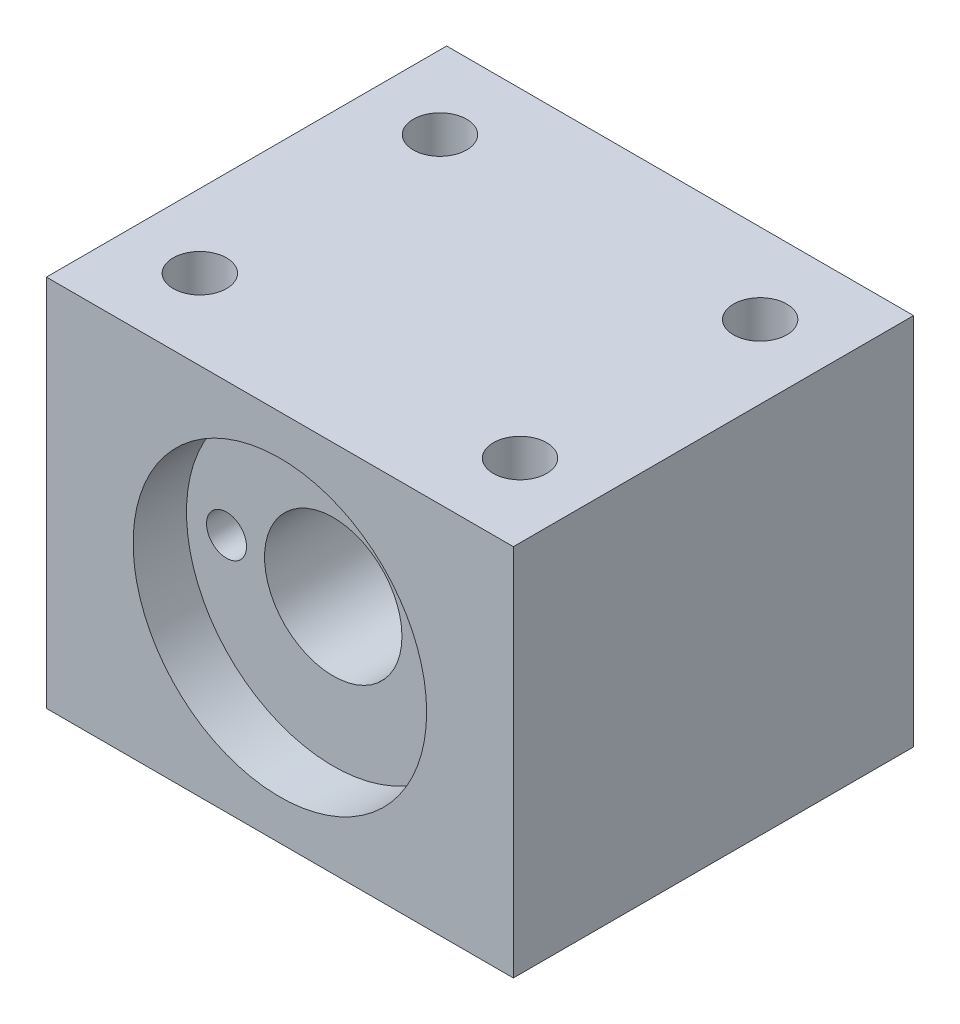
ISO-10303-21;
HEADER;
FILE_DESCRIPTION(('STEP AP214'),'2;1');
FILE_NAME('part.step','',(''),(''),'','','');
FILE_SCHEMA(('AUTOMOTIVE_DESIGN { 1 0 10303 214 1 1 1 1 }'));
ENDSEC;
DATA;
#1=APPLICATION_CONTEXT('core data for automotive mechanical design processes');
#2=APPLICATION_PROTOCOL_DEFINITION('international standard','automotive_design',2000,#1);
#3=PRODUCT_CONTEXT('',#1,'mechanical');
#4=PRODUCT('Part','Part','',(#3));
#5=PRODUCT_RELATED_PRODUCT_CATEGORY('part','',(#4));
#6=PRODUCT_DEFINITION_FORMATION('','',#4);
#7=PRODUCT_DEFINITION_CONTEXT('part definition',#1,'design');
#8=PRODUCT_DEFINITION('design','',#6,#7);
#9=PRODUCT_DEFINITION_SHAPE('','',#8);
#10=(LENGTH_UNIT() NAMED_UNIT(*) SI_UNIT(.MILLI.,.METRE.));
#11=(NAMED_UNIT(*) PLANE_ANGLE_UNIT() SI_UNIT($,.RADIAN.));
#12=(NAMED_UNIT(*) SI_UNIT($,.STERADIAN.) SOLID_ANGLE_UNIT());
#13=UNCERTAINTY_MEASURE_WITH_UNIT(LENGTH_MEASURE(1.E-05),#10,'distance_accuracy_value','');
#14=(GEOMETRIC_REPRESENTATION_CONTEXT(3) GLOBAL_UNCERTAINTY_ASSIGNED_CONTEXT((#13)) GLOBAL_UNIT_ASSIGNED_CONTEXT((#10,
#11,#12)) REPRESENTATION_CONTEXT('',''));
#15=CARTESIAN_POINT('',(0.,0.,0.));
#16=DIRECTION('',(0.,0.,1.));
#17=DIRECTION('',(1.,0.,0.));
#18=AXIS2_PLACEMENT_3D('',#15,#16,#17);
#19=CARTESIAN_POINT('',(0.,0.,0.));
#20=DIRECTION('',(0.,0.,1.));
#21=DIRECTION('',(1.,0.,0.));
#22=AXIS2_PLACEMENT_3D('',#19,#20,#21);
#23=CYLINDRICAL_SURFACE('',#22,5.15);
#24=CARTESIAN_POINT('',(0.,0.,0.));
#25=DIRECTION('',(0.,0.,1.));
#26=DIRECTION('',(1.,0.,0.));
#27=AXIS2_PLACEMENT_3D('',#24,#25,#26);
#28=CIRCLE('',#27,5.15);
#29=CARTESIAN_POINT('',(5.15,0.,0.));
#30=VERTEX_POINT('',#29);
#31=EDGE_CURVE('E102',#30,#30,#28,.T.);
#32=ORIENTED_EDGE('',*,*,#31,.F.);
#33=EDGE_LOOP('',(#32));
#34=FACE_BOUND('',#33,.T.);
#35=CARTESIAN_POINT('',(0.,0.,26.));
#36=DIRECTION('',(0.,0.,1.));
#37=DIRECTION('',(1.,0.,0.));
#38=AXIS2_PLACEMENT_3D('',#35,#36,#37);
#39=CIRCLE('',#38,5.15);
#40=CARTESIAN_POINT('',(5.15,0.,26.));
#41=VERTEX_POINT('',#40);
#42=EDGE_CURVE('E37',#41,#41,#39,.F.);
#43=ORIENTED_EDGE('',*,*,#42,.F.);
#44=EDGE_LOOP('',(#43));
#45=FACE_BOUND('',#44,.T.);
#46=ADVANCED_FACE('F33',(#34,#45),#23,.F.);
#47=CARTESIAN_POINT('',(-17.5,-14.,30.));
#48=DIRECTION('',(1.,0.,0.));
#49=DIRECTION('',(0.,0.,-1.));
#50=AXIS2_PLACEMENT_3D('',#47,#48,#49);
#51=PLANE('',#50);
#52=DIRECTION('',(0.,-1.,0.));
#53=VECTOR('',#52,1.);
#54=CARTESIAN_POINT('',(-17.5,-14.,0.));
#55=LINE('',#54,#53);
#56=CARTESIAN_POINT('',(-17.5,14.,0.));
#57=VERTEX_POINT('',#56);
#58=CARTESIAN_POINT('',(-17.5,-14.,0.));
#59=VERTEX_POINT('',#58);
#60=EDGE_CURVE('E99',#57,#59,#55,.T.);
#61=ORIENTED_EDGE('',*,*,#60,.T.);
#62=DIRECTION('',(0.,0.,-1.));
#63=VECTOR('',#62,1.);
#64=CARTESIAN_POINT('',(-17.5,-14.,30.));
#65=LINE('',#64,#63);
#66=CARTESIAN_POINT('',(-17.5,-14.,30.));
#67=VERTEX_POINT('',#66);
#68=EDGE_CURVE('E11',#67,#59,#65,.T.);
#69=ORIENTED_EDGE('',*,*,#68,.F.);
#70=DIRECTION('',(0.,-1.,0.));
#71=VECTOR('',#70,1.);
#72=CARTESIAN_POINT('',(-17.5,-14.,30.));
#73=LINE('',#72,#71);
#74=CARTESIAN_POINT('',(-17.5,14.,30.));
#75=VERTEX_POINT('',#74);
#76=EDGE_CURVE('E86',#75,#67,#73,.T.);
#77=ORIENTED_EDGE('',*,*,#76,.F.);
#78=DIRECTION('',(0.,0.,-1.));
#79=VECTOR('',#78,1.);
#80=CARTESIAN_POINT('',(-17.5,14.,30.));
#81=LINE('',#80,#79);
#82=EDGE_CURVE('E95',#75,#57,#81,.T.);
#83=ORIENTED_EDGE('',*,*,#82,.T.);
#84=EDGE_LOOP('',(#61,#69,#77,#83));
#85=FACE_BOUND('',#84,.T.);
#86=ADVANCED_FACE('F35',(#85),#51,.F.);
#87=CARTESIAN_POINT('',(17.5,-14.,30.));
#88=DIRECTION('',(0.,1.,0.));
#89=DIRECTION('',(-1.,0.,0.));
#90=AXIS2_PLACEMENT_3D('',#87,#88,#89);
#91=PLANE('',#90);
#92=DIRECTION('',(1.,0.,0.));
#93=VECTOR('',#92,1.);
#94=CARTESIAN_POINT('',(17.5,-14.,0.));
#95=LINE('',#94,#93);
#96=CARTESIAN_POINT('',(17.5,-14.,0.));
#97=VERTEX_POINT('',#96);
#98=EDGE_CURVE('E90',#59,#97,#95,.T.);
#99=ORIENTED_EDGE('',*,*,#98,.T.);
#100=DIRECTION('',(0.,0.,-1.));
#101=VECTOR('',#100,1.);
#102=CARTESIAN_POINT('',(17.5,-14.,30.));
#103=LINE('',#102,#101);
#104=CARTESIAN_POINT('',(17.5,-14.,30.));
#105=VERTEX_POINT('',#104);
#106=EDGE_CURVE('E43',#105,#97,#103,.T.);
#107=ORIENTED_EDGE('',*,*,#106,.F.);
#108=DIRECTION('',(1.,0.,0.));
#109=VECTOR('',#108,1.);
#110=CARTESIAN_POINT('',(17.5,-14.,30.));
#111=LINE('',#110,#109);
#112=EDGE_CURVE('E81',#67,#105,#111,.T.);
#113=ORIENTED_EDGE('',*,*,#112,.F.);
#114=ORIENTED_EDGE('',*,*,#68,.T.);
#115=EDGE_LOOP('',(#99,#107,#113,#114));
#116=FACE_BOUND('',#115,.T.);
#117=ADVANCED_FACE('F89',(#116),#91,.F.);
#118=CARTESIAN_POINT('',(17.5,-14.,30.));
#119=DIRECTION('',(-1.,0.,0.));
#120=DIRECTION('',(0.,0.,1.));
#121=AXIS2_PLACEMENT_3D('',#118,#119,#120);
#122=PLANE('',#121);
#123=DIRECTION('',(0.,1.,0.));
#124=VECTOR('',#123,1.);
#125=CARTESIAN_POINT('',(17.5,-14.,0.));
#126=LINE('',#125,#124);
#127=CARTESIAN_POINT('',(17.5,14.,0.));
#128=VERTEX_POINT('',#127);
#129=EDGE_CURVE('E68',#97,#128,#126,.T.);
#130=ORIENTED_EDGE('',*,*,#129,.T.);
#131=DIRECTION('',(0.,0.,-1.));
#132=VECTOR('',#131,1.);
#133=CARTESIAN_POINT('',(17.5,14.,30.));
#134=LINE('',#133,#132);
#135=CARTESIAN_POINT('',(17.5,14.,30.));
#136=VERTEX_POINT('',#135);
#137=EDGE_CURVE('E91',#136,#128,#134,.T.);
#138=ORIENTED_EDGE('',*,*,#137,.F.);
#139=DIRECTION('',(0.,1.,0.));
#140=VECTOR('',#139,1.);
#141=CARTESIAN_POINT('',(17.5,-14.,30.));
#142=LINE('',#141,#140);
#143=EDGE_CURVE('E84',#105,#136,#142,.T.);
#144=ORIENTED_EDGE('',*,*,#143,.F.);
#145=ORIENTED_EDGE('',*,*,#106,.T.);
#146=EDGE_LOOP('',(#130,#138,#144,#145));
#147=FACE_BOUND('',#146,.T.);
#148=ADVANCED_FACE('F93',(#147),#122,.F.);
#149=CARTESIAN_POINT('',(17.5,14.,30.));
#150=DIRECTION('',(0.,-1.,0.));
#151=DIRECTION('',(1.,0.,0.));
#152=AXIS2_PLACEMENT_3D('',#149,#150,#151);
#153=PLANE('',#152);
#154=CARTESIAN_POINT('',(-12.,14.,6.));
#155=DIRECTION('',(0.,1.,0.));
#156=DIRECTION('',(1.,0.,0.));
#157=AXIS2_PLACEMENT_3D('',#154,#155,#156);
#158=CIRCLE('',#157,2.);
#159=CARTESIAN_POINT('',(-10.,14.,6.));
#160=VERTEX_POINT('',#159);
#161=EDGE_CURVE('E140',#160,#160,#158,.T.);
#162=ORIENTED_EDGE('',*,*,#161,.F.);
#163=EDGE_LOOP('',(#162));
#164=FACE_BOUND('',#163,.T.);
#165=CARTESIAN_POINT('',(12.,14.,5.99999999999999));
#166=DIRECTION('',(0.,1.,0.));
#167=DIRECTION('',(-1.,0.,0.));
#168=AXIS2_PLACEMENT_3D('',#165,#166,#167);
#169=CIRCLE('',#168,2.);
#170=CARTESIAN_POINT('',(10.,14.,5.99999999999999));
#171=VERTEX_POINT('',#170);
#172=EDGE_CURVE('E146',#171,#171,#169,.T.);
#173=ORIENTED_EDGE('',*,*,#172,.F.);
#174=EDGE_LOOP('',(#173));
#175=FACE_BOUND('',#174,.T.);
#176=CARTESIAN_POINT('',(12.,14.,24.));
#177=DIRECTION('',(0.,1.,0.));
#178=DIRECTION('',(1.,0.,0.));
#179=AXIS2_PLACEMENT_3D('',#176,#177,#178);
#180=CIRCLE('',#179,2.);
#181=CARTESIAN_POINT('',(14.,14.,24.));
#182=VERTEX_POINT('',#181);
#183=EDGE_CURVE('E152',#182,#182,#180,.T.);
#184=ORIENTED_EDGE('',*,*,#183,.F.);
#185=EDGE_LOOP('',(#184));
#186=FACE_BOUND('',#185,.T.);
#187=CARTESIAN_POINT('',(-12.,14.,24.));
#188=DIRECTION('',(0.,1.,0.));
#189=DIRECTION('',(-1.,0.,0.));
#190=AXIS2_PLACEMENT_3D('',#187,#188,#189);
#191=CIRCLE('',#190,2.);
#192=CARTESIAN_POINT('',(-14.,14.,24.));
#193=VERTEX_POINT('',#192);
#194=EDGE_CURVE('E134',#193,#193,#191,.T.);
#195=ORIENTED_EDGE('',*,*,#194,.F.);
#196=EDGE_LOOP('',(#195));
#197=FACE_BOUND('',#196,.T.);
#198=DIRECTION('',(-1.,0.,0.));
#199=VECTOR('',#198,1.);
#200=CARTESIAN_POINT('',(17.5,14.,0.));
#201=LINE('',#200,#199);
#202=EDGE_CURVE('E74',#128,#57,#201,.T.);
#203=ORIENTED_EDGE('',*,*,#202,.T.);
#204=ORIENTED_EDGE('',*,*,#82,.F.);
#205=DIRECTION('',(-1.,0.,0.));
#206=VECTOR('',#205,1.);
#207=CARTESIAN_POINT('',(17.5,14.,30.));
#208=LINE('',#207,#206);
#209=EDGE_CURVE('E51',#136,#75,#208,.T.);
#210=ORIENTED_EDGE('',*,*,#209,.F.);
#211=ORIENTED_EDGE('',*,*,#137,.T.);
#212=EDGE_LOOP('',(#203,#204,#210,#211));
#213=FACE_BOUND('',#212,.T.);
#214=ADVANCED_FACE('F107',(#164,#175,#186,#197,#213),#153,.F.);
#215=CARTESIAN_POINT('',(0.,0.,30.));
#216=DIRECTION('',(0.,0.,1.));
#217=DIRECTION('',(1.,0.,0.));
#218=AXIS2_PLACEMENT_3D('',#215,#216,#217);
#219=PLANE('',#218);
#220=CARTESIAN_POINT('',(0.,0.,30.));
#221=DIRECTION('',(0.,0.,1.));
#222=DIRECTION('',(1.,0.,0.));
#223=AXIS2_PLACEMENT_3D('',#220,#221,#222);
#224=CIRCLE('',#223,11.);
#225=CARTESIAN_POINT('',(11.,0.,30.));
#226=VERTEX_POINT('',#225);
#227=EDGE_CURVE('E115',#226,#226,#224,.T.);
#228=ORIENTED_EDGE('',*,*,#227,.F.);
#229=EDGE_LOOP('',(#228));
#230=FACE_BOUND('',#229,.T.);
#231=ORIENTED_EDGE('',*,*,#76,.T.);
#232=ORIENTED_EDGE('',*,*,#112,.T.);
#233=ORIENTED_EDGE('',*,*,#143,.T.);
#234=ORIENTED_EDGE('',*,*,#209,.T.);
#235=EDGE_LOOP('',(#231,#232,#233,#234));
#236=FACE_BOUND('',#235,.T.);
#237=ADVANCED_FACE('F82',(#230,#236),#219,.T.);
#238=CARTESIAN_POINT('',(0.,0.,0.));
#239=DIRECTION('',(0.,0.,1.));
#240=DIRECTION('',(1.,0.,0.));
#241=AXIS2_PLACEMENT_3D('',#238,#239,#240);
#242=PLANE('',#241);
#243=ORIENTED_EDGE('',*,*,#31,.T.);
#244=EDGE_LOOP('',(#243));
#245=FACE_BOUND('',#244,.T.);
#246=ORIENTED_EDGE('',*,*,#60,.F.);
#247=ORIENTED_EDGE('',*,*,#202,.F.);
#248=ORIENTED_EDGE('',*,*,#129,.F.);
#249=ORIENTED_EDGE('',*,*,#98,.F.);
#250=EDGE_LOOP('',(#246,#247,#248,#249));
#251=FACE_BOUND('',#250,.T.);
#252=ADVANCED_FACE('F110',(#245,#251),#242,.F.);
#253=CARTESIAN_POINT('',(0.,0.,26.));
#254=DIRECTION('',(0.,0.,1.));
#255=DIRECTION('',(1.,0.,0.));
#256=AXIS2_PLACEMENT_3D('',#253,#254,#255);
#257=PLANE('',#256);
#258=CARTESIAN_POINT('',(-8.,0.,26.));
#259=DIRECTION('',(0.,0.,1.));
#260=DIRECTION('',(1.,0.,0.));
#261=AXIS2_PLACEMENT_3D('',#258,#259,#260);
#262=CIRCLE('',#261,1.5);
#263=CARTESIAN_POINT('',(-6.5,0.,26.));
#264=VERTEX_POINT('',#263);
#265=EDGE_CURVE('E129',#264,#264,#262,.T.);
#266=ORIENTED_EDGE('',*,*,#265,.F.);
#267=EDGE_LOOP('',(#266));
#268=FACE_BOUND('',#267,.T.);
#269=CARTESIAN_POINT('',(8.,0.,26.));
#270=DIRECTION('',(0.,0.,1.));
#271=DIRECTION('',(-1.,0.,0.));
#272=AXIS2_PLACEMENT_3D('',#269,#270,#271);
#273=CIRCLE('',#272,1.5);
#274=CARTESIAN_POINT('',(6.5,0.,26.));
#275=VERTEX_POINT('',#274);
#276=EDGE_CURVE('E122',#275,#275,#273,.T.);
#277=ORIENTED_EDGE('',*,*,#276,.F.);
#278=EDGE_LOOP('',(#277));
#279=FACE_BOUND('',#278,.T.);
#280=CARTESIAN_POINT('',(0.,0.,26.));
#281=DIRECTION('',(0.,0.,1.));
#282=DIRECTION('',(1.,0.,0.));
#283=AXIS2_PLACEMENT_3D('',#280,#281,#282);
#284=CIRCLE('',#283,11.);
#285=CARTESIAN_POINT('',(11.,0.,26.));
#286=VERTEX_POINT('',#285);
#287=EDGE_CURVE('E118',#286,#286,#284,.T.);
#288=ORIENTED_EDGE('',*,*,#287,.T.);
#289=EDGE_LOOP('',(#288));
#290=FACE_BOUND('',#289,.T.);
#291=ORIENTED_EDGE('',*,*,#42,.T.);
#292=EDGE_LOOP('',(#291));
#293=FACE_BOUND('',#292,.T.);
#294=ADVANCED_FACE('F204',(#268,#279,#290,#293),#257,.T.);
#295=CARTESIAN_POINT('',(0.,0.,26.));
#296=DIRECTION('',(0.,0.,1.));
#297=DIRECTION('',(1.,0.,0.));
#298=AXIS2_PLACEMENT_3D('',#295,#296,#297);
#299=CYLINDRICAL_SURFACE('',#298,11.);
#300=ORIENTED_EDGE('',*,*,#287,.F.);
#301=EDGE_LOOP('',(#300));
#302=FACE_BOUND('',#301,.T.);
#303=ORIENTED_EDGE('',*,*,#227,.T.);
#304=EDGE_LOOP('',(#303));
#305=FACE_BOUND('',#304,.T.);
#306=ADVANCED_FACE('F198',(#302,#305),#299,.F.);
#307=CARTESIAN_POINT('',(8.,0.,16.));
#308=DIRECTION('',(0.,0.,1.));
#309=DIRECTION('',(1.,0.,0.));
#310=AXIS2_PLACEMENT_3D('',#307,#308,#309);
#311=CYLINDRICAL_SURFACE('',#310,1.5);
#312=CARTESIAN_POINT('',(8.,0.,16.));
#313=DIRECTION('',(0.,0.,1.));
#314=DIRECTION('',(-1.,0.,0.));
#315=AXIS2_PLACEMENT_3D('',#312,#313,#314);
#316=CIRCLE('',#315,1.5);
#317=CARTESIAN_POINT('',(6.5,0.,16.));
#318=VERTEX_POINT('',#317);
#319=EDGE_CURVE('E125',#318,#318,#316,.T.);
#320=ORIENTED_EDGE('',*,*,#319,.F.);
#321=EDGE_LOOP('',(#320));
#322=FACE_BOUND('',#321,.T.);
#323=ORIENTED_EDGE('',*,*,#276,.T.);
#324=EDGE_LOOP('',(#323));
#325=FACE_BOUND('',#324,.T.);
#326=ADVANCED_FACE('F243',(#322,#325),#311,.F.);
#327=CARTESIAN_POINT('',(8.,0.,16.));
#328=DIRECTION('',(0.,0.,-1.));
#329=DIRECTION('',(-1.,0.,0.));
#330=AXIS2_PLACEMENT_3D('',#327,#328,#329);
#331=PLANE('',#330);
#332=ORIENTED_EDGE('',*,*,#319,.T.);
#333=EDGE_LOOP('',(#332));
#334=FACE_BOUND('',#333,.T.);
#335=ADVANCED_FACE('F249',(#334),#331,.F.);
#336=CARTESIAN_POINT('',(-8.,0.,16.));
#337=DIRECTION('',(0.,0.,1.));
#338=DIRECTION('',(1.,0.,0.));
#339=AXIS2_PLACEMENT_3D('',#336,#337,#338);
#340=CYLINDRICAL_SURFACE('',#339,1.5);
#341=CARTESIAN_POINT('',(-8.,0.,16.));
#342=DIRECTION('',(0.,0.,1.));
#343=DIRECTION('',(1.,0.,0.));
#344=AXIS2_PLACEMENT_3D('',#341,#342,#343);
#345=CIRCLE('',#344,1.5);
#346=CARTESIAN_POINT('',(-6.5,0.,16.));
#347=VERTEX_POINT('',#346);
#348=EDGE_CURVE('E119',#347,#347,#345,.T.);
#349=ORIENTED_EDGE('',*,*,#348,.F.);
#350=EDGE_LOOP('',(#349));
#351=FACE_BOUND('',#350,.T.);
#352=ORIENTED_EDGE('',*,*,#265,.T.);
#353=EDGE_LOOP('',(#352));
#354=FACE_BOUND('',#353,.T.);
#355=ADVANCED_FACE('F184',(#351,#354),#340,.F.);
#356=CARTESIAN_POINT('',(-8.,0.,16.));
#357=DIRECTION('',(0.,0.,1.));
#358=DIRECTION('',(1.,0.,0.));
#359=AXIS2_PLACEMENT_3D('',#356,#357,#358);
#360=PLANE('',#359);
#361=ORIENTED_EDGE('',*,*,#348,.T.);
#362=EDGE_LOOP('',(#361));
#363=FACE_BOUND('',#362,.T.);
#364=ADVANCED_FACE('F175',(#363),#360,.T.);
#365=CARTESIAN_POINT('',(-12.,7.,24.));
#366=DIRECTION('',(0.,1.,0.));
#367=DIRECTION('',(-1.,0.,0.));
#368=AXIS2_PLACEMENT_3D('',#365,#366,#367);
#369=CYLINDRICAL_SURFACE('',#368,2.);
#370=CARTESIAN_POINT('',(-12.,7.,24.));
#371=DIRECTION('',(0.,1.,0.));
#372=DIRECTION('',(-1.,0.,0.));
#373=AXIS2_PLACEMENT_3D('',#370,#371,#372);
#374=CIRCLE('',#373,2.);
#375=CARTESIAN_POINT('',(-14.,7.,24.));
#376=VERTEX_POINT('',#375);
#377=EDGE_CURVE('E126',#376,#376,#374,.T.);
#378=ORIENTED_EDGE('',*,*,#377,.F.);
#379=EDGE_LOOP('',(#378));
#380=FACE_BOUND('',#379,.T.);
#381=ORIENTED_EDGE('',*,*,#194,.T.);
#382=EDGE_LOOP('',(#381));
#383=FACE_BOUND('',#382,.T.);
#384=ADVANCED_FACE('F173',(#380,#383),#369,.F.);
#385=CARTESIAN_POINT('',(-12.,7.,24.));
#386=DIRECTION('',(0.,1.,0.));
#387=DIRECTION('',(-1.,0.,0.));
#388=AXIS2_PLACEMENT_3D('',#385,#386,#387);
#389=PLANE('',#388);
#390=ORIENTED_EDGE('',*,*,#377,.T.);
#391=EDGE_LOOP('',(#390));
#392=FACE_BOUND('',#391,.T.);
#393=ADVANCED_FACE('F163',(#392),#389,.T.);
#394=CARTESIAN_POINT('',(12.,7.,24.));
#395=DIRECTION('',(0.,1.,0.));
#396=DIRECTION('',(-1.,0.,0.));
#397=AXIS2_PLACEMENT_3D('',#394,#395,#396);
#398=CYLINDRICAL_SURFACE('',#397,2.);
#399=CARTESIAN_POINT('',(12.,7.,24.));
#400=DIRECTION('',(0.,1.,0.));
#401=DIRECTION('',(1.,0.,0.));
#402=AXIS2_PLACEMENT_3D('',#399,#400,#401);
#403=CIRCLE('',#402,2.);
#404=CARTESIAN_POINT('',(14.,7.,24.));
#405=VERTEX_POINT('',#404);
#406=EDGE_CURVE('E137',#405,#405,#403,.T.);
#407=ORIENTED_EDGE('',*,*,#406,.F.);
#408=EDGE_LOOP('',(#407));
#409=FACE_BOUND('',#408,.T.);
#410=ORIENTED_EDGE('',*,*,#183,.T.);
#411=EDGE_LOOP('',(#410));
#412=FACE_BOUND('',#411,.T.);
#413=ADVANCED_FACE('F160',(#409,#412),#398,.F.);
#414=CARTESIAN_POINT('',(12.,7.,24.));
#415=DIRECTION('',(0.,-1.,0.));
#416=DIRECTION('',(1.,0.,0.));
#417=AXIS2_PLACEMENT_3D('',#414,#415,#416);
#418=PLANE('',#417);
#419=ORIENTED_EDGE('',*,*,#406,.T.);
#420=EDGE_LOOP('',(#419));
#421=FACE_BOUND('',#420,.T.);
#422=ADVANCED_FACE('F158',(#421),#418,.F.);
#423=CARTESIAN_POINT('',(12.,7.,5.99999999999999));
#424=DIRECTION('',(0.,1.,0.));
#425=DIRECTION('',(-1.,0.,0.));
#426=AXIS2_PLACEMENT_3D('',#423,#424,#425);
#427=CYLINDRICAL_SURFACE('',#426,2.);
#428=CARTESIAN_POINT('',(12.,7.,5.99999999999999));
#429=DIRECTION('',(0.,1.,0.));
#430=DIRECTION('',(-1.,0.,0.));
#431=AXIS2_PLACEMENT_3D('',#428,#429,#430);
#432=CIRCLE('',#431,2.);
#433=CARTESIAN_POINT('',(10.,7.,5.99999999999999));
#434=VERTEX_POINT('',#433);
#435=EDGE_CURVE('E149',#434,#434,#432,.T.);
#436=ORIENTED_EDGE('',*,*,#435,.F.);
#437=EDGE_LOOP('',(#436));
#438=FACE_BOUND('',#437,.T.);
#439=ORIENTED_EDGE('',*,*,#172,.T.);
#440=EDGE_LOOP('',(#439));
#441=FACE_BOUND('',#440,.T.);
#442=ADVANCED_FACE('F294',(#438,#441),#427,.F.);
#443=CARTESIAN_POINT('',(12.,7.,5.99999999999999));
#444=DIRECTION('',(0.,1.,0.));
#445=DIRECTION('',(-1.,0.,0.));
#446=AXIS2_PLACEMENT_3D('',#443,#444,#445);
#447=PLANE('',#446);
#448=ORIENTED_EDGE('',*,*,#435,.T.);
#449=EDGE_LOOP('',(#448));
#450=FACE_BOUND('',#449,.T.);
#451=ADVANCED_FACE('F302',(#450),#447,.T.);
#452=CARTESIAN_POINT('',(-12.,7.,6.));
#453=DIRECTION('',(0.,1.,0.));
#454=DIRECTION('',(-1.,0.,0.));
#455=AXIS2_PLACEMENT_3D('',#452,#453,#454);
#456=CYLINDRICAL_SURFACE('',#455,2.);
#457=CARTESIAN_POINT('',(-12.,7.,6.));
#458=DIRECTION('',(0.,1.,0.));
#459=DIRECTION('',(1.,0.,0.));
#460=AXIS2_PLACEMENT_3D('',#457,#458,#459);
#461=CIRCLE('',#460,2.);
#462=CARTESIAN_POINT('',(-10.,7.,6.));
#463=VERTEX_POINT('',#462);
#464=EDGE_CURVE('E143',#463,#463,#461,.T.);
#465=ORIENTED_EDGE('',*,*,#464,.F.);
#466=EDGE_LOOP('',(#465));
#467=FACE_BOUND('',#466,.T.);
#468=ORIENTED_EDGE('',*,*,#161,.T.);
#469=EDGE_LOOP('',(#468));
#470=FACE_BOUND('',#469,.T.);
#471=ADVANCED_FACE('F311',(#467,#470),#456,.F.);
#472=CARTESIAN_POINT('',(-12.,7.,6.));
#473=DIRECTION('',(0.,-1.,0.));
#474=DIRECTION('',(1.,0.,0.));
#475=AXIS2_PLACEMENT_3D('',#472,#473,#474);
#476=PLANE('',#475);
#477=ORIENTED_EDGE('',*,*,#464,.T.);
#478=EDGE_LOOP('',(#477));
#479=FACE_BOUND('',#478,.T.);
#480=ADVANCED_FACE('F320',(#479),#476,.F.);
#481=CLOSED_SHELL('',(#46,#86,#117,#148,#214,#237,#252,#294,#306,#326,#335,#355,#364,#384,#393,
#413,#422,#442,#451,#471,#480));
#482=MANIFOLD_SOLID_BREP('B2',#481);
#483=ADVANCED_BREP_SHAPE_REPRESENTATION('',(#18,#482),#14);
#484=SHAPE_DEFINITION_REPRESENTATION(#9,#483);
ENDSEC;
END-ISO-10303-21;
